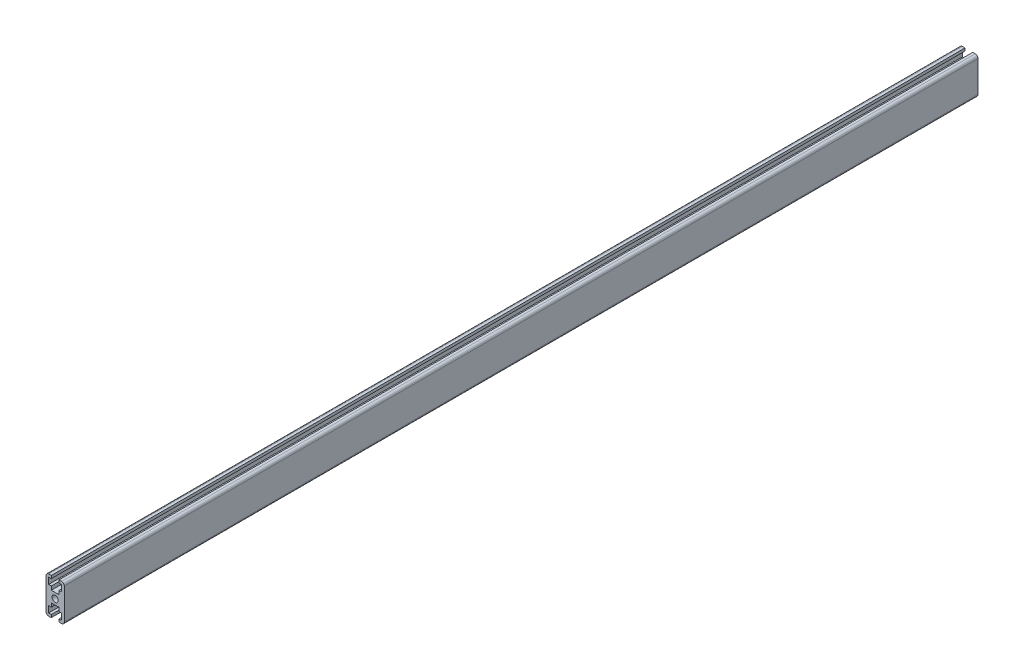
ISO-10303-21;
HEADER;
FILE_DESCRIPTION(('STEP AP214'),'2;1');
FILE_NAME('part.step','',(''),(''),'','','');
FILE_SCHEMA(('AUTOMOTIVE_DESIGN { 1 0 10303 214 1 1 1 1 }'));
ENDSEC;
DATA;
#1=APPLICATION_CONTEXT('core data for automotive mechanical design processes');
#2=APPLICATION_PROTOCOL_DEFINITION('international standard','automotive_design',2000,#1);
#3=PRODUCT_CONTEXT('',#1,'mechanical');
#4=PRODUCT('Part','Part','',(#3));
#5=PRODUCT_RELATED_PRODUCT_CATEGORY('part','',(#4));
#6=PRODUCT_DEFINITION_FORMATION('','',#4);
#7=PRODUCT_DEFINITION_CONTEXT('part definition',#1,'design');
#8=PRODUCT_DEFINITION('design','',#6,#7);
#9=PRODUCT_DEFINITION_SHAPE('','',#8);
#10=(LENGTH_UNIT() NAMED_UNIT(*) SI_UNIT(.MILLI.,.METRE.));
#11=(NAMED_UNIT(*) PLANE_ANGLE_UNIT() SI_UNIT($,.RADIAN.));
#12=(NAMED_UNIT(*) SI_UNIT($,.STERADIAN.) SOLID_ANGLE_UNIT());
#13=UNCERTAINTY_MEASURE_WITH_UNIT(LENGTH_MEASURE(1.E-05),#10,'distance_accuracy_value','');
#14=(GEOMETRIC_REPRESENTATION_CONTEXT(3) GLOBAL_UNCERTAINTY_ASSIGNED_CONTEXT((#13)) GLOBAL_UNIT_ASSIGNED_CONTEXT((#10,
#11,#12)) REPRESENTATION_CONTEXT('',''));
#15=CARTESIAN_POINT('',(0.,0.,0.));
#16=DIRECTION('',(0.,0.,1.));
#17=DIRECTION('',(1.,0.,0.));
#18=AXIS2_PLACEMENT_3D('',#15,#16,#17);
#19=CARTESIAN_POINT('',(1.43563322149805E-13,-20.,1000.));
#20=DIRECTION('',(0.,-1.,0.));
#21=DIRECTION('',(1.,0.,0.));
#22=AXIS2_PLACEMENT_3D('',#19,#20,#21);
#23=PLANE('',#22);
#24=DIRECTION('',(-1.,0.,0.));
#25=VECTOR('',#24,1.);
#26=CARTESIAN_POINT('',(1.43563322149805E-13,-20.,0.));
#27=LINE('',#26,#25);
#28=CARTESIAN_POINT('',(-4.1999999999999,-20.,0.));
#29=VERTEX_POINT('',#28);
#30=CARTESIAN_POINT('',(-7.,-20.,0.));
#31=VERTEX_POINT('',#30);
#32=EDGE_CURVE('E277',#29,#31,#27,.T.);
#33=ORIENTED_EDGE('',*,*,#32,.F.);
#34=DIRECTION('',(0.,0.,-1.));
#35=VECTOR('',#34,1.);
#36=CARTESIAN_POINT('',(-4.1999999999999,-20.,1000.));
#37=LINE('',#36,#35);
#38=CARTESIAN_POINT('',(-4.1999999999999,-20.,1000.));
#39=VERTEX_POINT('',#38);
#40=EDGE_CURVE('E11',#39,#29,#37,.T.);
#41=ORIENTED_EDGE('',*,*,#40,.F.);
#42=DIRECTION('',(-1.,0.,0.));
#43=VECTOR('',#42,1.);
#44=CARTESIAN_POINT('',(1.43563322149805E-13,-20.,1000.));
#45=LINE('',#44,#43);
#46=CARTESIAN_POINT('',(-7.,-20.,1000.));
#47=VERTEX_POINT('',#46);
#48=EDGE_CURVE('E369',#39,#47,#45,.T.);
#49=ORIENTED_EDGE('',*,*,#48,.T.);
#50=DIRECTION('',(0.,0.,-1.));
#51=VECTOR('',#50,1.);
#52=CARTESIAN_POINT('',(-7.,-20.,1000.));
#53=LINE('',#52,#51);
#54=EDGE_CURVE('E160',#47,#31,#53,.T.);
#55=ORIENTED_EDGE('',*,*,#54,.T.);
#56=EDGE_LOOP('',(#33,#41,#49,#55));
#57=FACE_BOUND('',#56,.T.);
#58=ADVANCED_FACE('F37',(#57),#23,.T.);
#59=CARTESIAN_POINT('',(-4.20000000000004,0.,1000.));
#60=DIRECTION('',(1.,0.,0.));
#61=DIRECTION('',(0.,1.,0.));
#62=AXIS2_PLACEMENT_3D('',#59,#60,#61);
#63=PLANE('',#62);
#64=DIRECTION('',(0.,-1.,0.));
#65=VECTOR('',#64,1.);
#66=CARTESIAN_POINT('',(-4.20000000000004,0.,0.));
#67=LINE('',#66,#65);
#68=CARTESIAN_POINT('',(-4.19999999999992,-17.,0.));
#69=VERTEX_POINT('',#68);
#70=EDGE_CURVE('E280',#69,#29,#67,.T.);
#71=ORIENTED_EDGE('',*,*,#70,.F.);
#72=DIRECTION('',(0.,0.,-1.));
#73=VECTOR('',#72,1.);
#74=CARTESIAN_POINT('',(-4.19999999999992,-17.,1000.));
#75=LINE('',#74,#73);
#76=CARTESIAN_POINT('',(-4.19999999999992,-17.,1000.));
#77=VERTEX_POINT('',#76);
#78=EDGE_CURVE('E45',#77,#69,#75,.T.);
#79=ORIENTED_EDGE('',*,*,#78,.F.);
#80=DIRECTION('',(0.,-1.,0.));
#81=VECTOR('',#80,1.);
#82=CARTESIAN_POINT('',(-4.20000000000004,0.,1000.));
#83=LINE('',#82,#81);
#84=EDGE_CURVE('E449',#77,#39,#83,.T.);
#85=ORIENTED_EDGE('',*,*,#84,.T.);
#86=ORIENTED_EDGE('',*,*,#40,.T.);
#87=EDGE_LOOP('',(#71,#79,#85,#86));
#88=FACE_BOUND('',#87,.T.);
#89=ADVANCED_FACE('F436',(#88),#63,.T.);
#90=CARTESIAN_POINT('',(1.22028823827334E-13,-17.,1000.));
#91=DIRECTION('',(0.,1.,0.));
#92=DIRECTION('',(-1.,0.,0.));
#93=AXIS2_PLACEMENT_3D('',#90,#91,#92);
#94=PLANE('',#93);
#95=DIRECTION('',(1.,0.,0.));
#96=VECTOR('',#95,1.);
#97=CARTESIAN_POINT('',(1.22028823827334E-13,-17.,0.));
#98=LINE('',#97,#96);
#99=CARTESIAN_POINT('',(-7.09999999999992,-17.0000000000001,0.));
#100=VERTEX_POINT('',#99);
#101=EDGE_CURVE('E283',#100,#69,#98,.T.);
#102=ORIENTED_EDGE('',*,*,#101,.F.);
#103=DIRECTION('',(0.,0.,-1.));
#104=VECTOR('',#103,1.);
#105=CARTESIAN_POINT('',(-7.09999999999992,-17.0000000000001,1000.));
#106=LINE('',#105,#104);
#107=CARTESIAN_POINT('',(-7.09999999999992,-17.0000000000001,1000.));
#108=VERTEX_POINT('',#107);
#109=EDGE_CURVE('E425',#108,#100,#106,.T.);
#110=ORIENTED_EDGE('',*,*,#109,.F.);
#111=DIRECTION('',(1.,0.,0.));
#112=VECTOR('',#111,1.);
#113=CARTESIAN_POINT('',(1.22028823827334E-13,-17.,1000.));
#114=LINE('',#113,#112);
#115=EDGE_CURVE('E432',#108,#77,#114,.T.);
#116=ORIENTED_EDGE('',*,*,#115,.T.);
#117=ORIENTED_EDGE('',*,*,#78,.T.);
#118=EDGE_LOOP('',(#102,#110,#116,#117));
#119=FACE_BOUND('',#118,.T.);
#120=ADVANCED_FACE('F430',(#119),#94,.T.);
#121=CARTESIAN_POINT('',(-7.10000000000004,0.,1000.));
#122=DIRECTION('',(1.,0.,0.));
#123=DIRECTION('',(0.,1.,0.));
#124=AXIS2_PLACEMENT_3D('',#121,#122,#123);
#125=PLANE('',#124);
#126=DIRECTION('',(0.,-1.,0.));
#127=VECTOR('',#126,1.);
#128=CARTESIAN_POINT('',(-7.10000000000004,0.,0.));
#129=LINE('',#128,#127);
#130=CARTESIAN_POINT('',(-7.09999999999997,-10.,0.));
#131=VERTEX_POINT('',#130);
#132=EDGE_CURVE('E286',#131,#100,#129,.T.);
#133=ORIENTED_EDGE('',*,*,#132,.F.);
#134=DIRECTION('',(0.,0.,-1.));
#135=VECTOR('',#134,1.);
#136=CARTESIAN_POINT('',(-7.09999999999997,-10.,1000.));
#137=LINE('',#136,#135);
#138=CARTESIAN_POINT('',(-7.09999999999997,-10.,1000.));
#139=VERTEX_POINT('',#138);
#140=EDGE_CURVE('E423',#139,#131,#137,.T.);
#141=ORIENTED_EDGE('',*,*,#140,.F.);
#142=DIRECTION('',(0.,-1.,0.));
#143=VECTOR('',#142,1.);
#144=CARTESIAN_POINT('',(-7.10000000000004,0.,1000.));
#145=LINE('',#144,#143);
#146=EDGE_CURVE('E446',#139,#108,#145,.T.);
#147=ORIENTED_EDGE('',*,*,#146,.T.);
#148=ORIENTED_EDGE('',*,*,#109,.T.);
#149=EDGE_LOOP('',(#133,#141,#147,#148));
#150=FACE_BOUND('',#149,.T.);
#151=ADVANCED_FACE('F443',(#150),#125,.T.);
#152=CARTESIAN_POINT('',(0.,-10.,1000.));
#153=DIRECTION('',(0.,-1.,0.));
#154=DIRECTION('',(1.,0.,0.));
#155=AXIS2_PLACEMENT_3D('',#152,#153,#154);
#156=PLANE('',#155);
#157=DIRECTION('',(-1.,0.,0.));
#158=VECTOR('',#157,1.);
#159=CARTESIAN_POINT('',(0.,-10.,0.));
#160=LINE('',#159,#158);
#161=CARTESIAN_POINT('',(-4.19999999999997,-10.,0.));
#162=VERTEX_POINT('',#161);
#163=EDGE_CURVE('E289',#162,#131,#160,.T.);
#164=ORIENTED_EDGE('',*,*,#163,.F.);
#165=DIRECTION('',(0.,0.,-1.));
#166=VECTOR('',#165,1.);
#167=CARTESIAN_POINT('',(-4.19999999999997,-10.,1000.));
#168=LINE('',#167,#166);
#169=CARTESIAN_POINT('',(-4.19999999999997,-10.,1000.));
#170=VERTEX_POINT('',#169);
#171=EDGE_CURVE('E421',#170,#162,#168,.T.);
#172=ORIENTED_EDGE('',*,*,#171,.F.);
#173=DIRECTION('',(-1.,0.,0.));
#174=VECTOR('',#173,1.);
#175=CARTESIAN_POINT('',(0.,-10.,1000.));
#176=LINE('',#175,#174);
#177=EDGE_CURVE('E451',#170,#139,#176,.T.);
#178=ORIENTED_EDGE('',*,*,#177,.T.);
#179=ORIENTED_EDGE('',*,*,#140,.T.);
#180=EDGE_LOOP('',(#164,#172,#178,#179));
#181=FACE_BOUND('',#180,.T.);
#182=ADVANCED_FACE('F540',(#181),#156,.T.);
#183=CARTESIAN_POINT('',(-4.20000000000004,0.,1000.));
#184=DIRECTION('',(1.,0.,0.));
#185=DIRECTION('',(0.,1.,0.));
#186=AXIS2_PLACEMENT_3D('',#183,#184,#185);
#187=PLANE('',#186);
#188=DIRECTION('',(0.,-1.,0.));
#189=VECTOR('',#188,1.);
#190=CARTESIAN_POINT('',(-4.20000000000004,0.,0.));
#191=LINE('',#190,#189);
#192=CARTESIAN_POINT('',(-4.2,-6.00000000000003,0.));
#193=VERTEX_POINT('',#192);
#194=EDGE_CURVE('E292',#193,#162,#191,.T.);
#195=ORIENTED_EDGE('',*,*,#194,.F.);
#196=DIRECTION('',(0.,0.,-1.));
#197=VECTOR('',#196,1.);
#198=CARTESIAN_POINT('',(-4.2,-6.00000000000003,1000.));
#199=LINE('',#198,#197);
#200=CARTESIAN_POINT('',(-4.2,-6.00000000000003,1000.));
#201=VERTEX_POINT('',#200);
#202=EDGE_CURVE('E419',#201,#193,#199,.T.);
#203=ORIENTED_EDGE('',*,*,#202,.F.);
#204=DIRECTION('',(0.,-1.,0.));
#205=VECTOR('',#204,1.);
#206=CARTESIAN_POINT('',(-4.20000000000004,0.,1000.));
#207=LINE('',#206,#205);
#208=EDGE_CURVE('E457',#201,#170,#207,.T.);
#209=ORIENTED_EDGE('',*,*,#208,.T.);
#210=ORIENTED_EDGE('',*,*,#171,.T.);
#211=EDGE_LOOP('',(#195,#203,#209,#210));
#212=FACE_BOUND('',#211,.T.);
#213=ADVANCED_FACE('F543',(#212),#187,.T.);
#214=CARTESIAN_POINT('',(0.,-6.,1000.));
#215=DIRECTION('',(0.,-1.,0.));
#216=DIRECTION('',(1.,0.,0.));
#217=AXIS2_PLACEMENT_3D('',#214,#215,#216);
#218=PLANE('',#217);
#219=DIRECTION('',(-1.,0.,0.));
#220=VECTOR('',#219,1.);
#221=CARTESIAN_POINT('',(0.,-6.,0.));
#222=LINE('',#221,#220);
#223=CARTESIAN_POINT('',(4.2,-5.99999999999997,0.));
#224=VERTEX_POINT('',#223);
#225=EDGE_CURVE('E295',#224,#193,#222,.T.);
#226=ORIENTED_EDGE('',*,*,#225,.F.);
#227=DIRECTION('',(0.,0.,-1.));
#228=VECTOR('',#227,1.);
#229=CARTESIAN_POINT('',(4.2,-5.99999999999997,1000.));
#230=LINE('',#229,#228);
#231=CARTESIAN_POINT('',(4.2,-5.99999999999997,1000.));
#232=VERTEX_POINT('',#231);
#233=EDGE_CURVE('E417',#232,#224,#230,.T.);
#234=ORIENTED_EDGE('',*,*,#233,.F.);
#235=DIRECTION('',(-1.,0.,0.));
#236=VECTOR('',#235,1.);
#237=CARTESIAN_POINT('',(0.,-6.,1000.));
#238=LINE('',#237,#236);
#239=EDGE_CURVE('E460',#232,#201,#238,.T.);
#240=ORIENTED_EDGE('',*,*,#239,.T.);
#241=ORIENTED_EDGE('',*,*,#202,.T.);
#242=EDGE_LOOP('',(#226,#234,#240,#241));
#243=FACE_BOUND('',#242,.T.);
#244=ADVANCED_FACE('F547',(#243),#218,.T.);
#245=CARTESIAN_POINT('',(4.19999999999996,0.,1000.));
#246=DIRECTION('',(-1.,0.,0.));
#247=DIRECTION('',(0.,-1.,0.));
#248=AXIS2_PLACEMENT_3D('',#245,#246,#247);
#249=PLANE('',#248);
#250=DIRECTION('',(0.,1.,0.));
#251=VECTOR('',#250,1.);
#252=CARTESIAN_POINT('',(4.19999999999996,0.,0.));
#253=LINE('',#252,#251);
#254=CARTESIAN_POINT('',(4.20000000000003,-9.99999999999997,0.));
#255=VERTEX_POINT('',#254);
#256=EDGE_CURVE('E298',#255,#224,#253,.T.);
#257=ORIENTED_EDGE('',*,*,#256,.F.);
#258=DIRECTION('',(0.,0.,-1.));
#259=VECTOR('',#258,1.);
#260=CARTESIAN_POINT('',(4.20000000000003,-9.99999999999997,1000.));
#261=LINE('',#260,#259);
#262=CARTESIAN_POINT('',(4.20000000000003,-9.99999999999997,1000.));
#263=VERTEX_POINT('',#262);
#264=EDGE_CURVE('E415',#263,#255,#261,.T.);
#265=ORIENTED_EDGE('',*,*,#264,.F.);
#266=DIRECTION('',(0.,1.,0.));
#267=VECTOR('',#266,1.);
#268=CARTESIAN_POINT('',(4.19999999999996,0.,1000.));
#269=LINE('',#268,#267);
#270=EDGE_CURVE('E463',#263,#232,#269,.T.);
#271=ORIENTED_EDGE('',*,*,#270,.T.);
#272=ORIENTED_EDGE('',*,*,#233,.T.);
#273=EDGE_LOOP('',(#257,#265,#271,#272));
#274=FACE_BOUND('',#273,.T.);
#275=ADVANCED_FACE('F551',(#274),#249,.T.);
#276=CARTESIAN_POINT('',(0.,-10.,1000.));
#277=DIRECTION('',(0.,-1.,0.));
#278=DIRECTION('',(1.,0.,0.));
#279=AXIS2_PLACEMENT_3D('',#276,#277,#278);
#280=PLANE('',#279);
#281=DIRECTION('',(-1.,0.,0.));
#282=VECTOR('',#281,1.);
#283=CARTESIAN_POINT('',(0.,-10.,0.));
#284=LINE('',#283,#282);
#285=CARTESIAN_POINT('',(7.10000000000003,-9.99999999999995,0.));
#286=VERTEX_POINT('',#285);
#287=EDGE_CURVE('E301',#286,#255,#284,.T.);
#288=ORIENTED_EDGE('',*,*,#287,.F.);
#289=DIRECTION('',(0.,0.,-1.));
#290=VECTOR('',#289,1.);
#291=CARTESIAN_POINT('',(7.10000000000003,-9.99999999999995,1000.));
#292=LINE('',#291,#290);
#293=CARTESIAN_POINT('',(7.10000000000003,-9.99999999999995,1000.));
#294=VERTEX_POINT('',#293);
#295=EDGE_CURVE('E413',#294,#286,#292,.T.);
#296=ORIENTED_EDGE('',*,*,#295,.F.);
#297=DIRECTION('',(-1.,0.,0.));
#298=VECTOR('',#297,1.);
#299=CARTESIAN_POINT('',(0.,-10.,1000.));
#300=LINE('',#299,#298);
#301=EDGE_CURVE('E466',#294,#263,#300,.T.);
#302=ORIENTED_EDGE('',*,*,#301,.T.);
#303=ORIENTED_EDGE('',*,*,#264,.T.);
#304=EDGE_LOOP('',(#288,#296,#302,#303));
#305=FACE_BOUND('',#304,.T.);
#306=ADVANCED_FACE('F555',(#305),#280,.T.);
#307=CARTESIAN_POINT('',(7.09999999999995,0.,1000.));
#308=DIRECTION('',(-1.,0.,0.));
#309=DIRECTION('',(0.,-1.,0.));
#310=AXIS2_PLACEMENT_3D('',#307,#308,#309);
#311=PLANE('',#310);
#312=DIRECTION('',(0.,1.,0.));
#313=VECTOR('',#312,1.);
#314=CARTESIAN_POINT('',(7.09999999999995,0.,0.));
#315=LINE('',#314,#313);
#316=CARTESIAN_POINT('',(7.10000000000008,-17.,0.));
#317=VERTEX_POINT('',#316);
#318=EDGE_CURVE('E304',#317,#286,#315,.T.);
#319=ORIENTED_EDGE('',*,*,#318,.F.);
#320=DIRECTION('',(0.,0.,-1.));
#321=VECTOR('',#320,1.);
#322=CARTESIAN_POINT('',(7.10000000000008,-17.,1000.));
#323=LINE('',#322,#321);
#324=CARTESIAN_POINT('',(7.10000000000008,-17.,1000.));
#325=VERTEX_POINT('',#324);
#326=EDGE_CURVE('E411',#325,#317,#323,.T.);
#327=ORIENTED_EDGE('',*,*,#326,.F.);
#328=DIRECTION('',(0.,1.,0.));
#329=VECTOR('',#328,1.);
#330=CARTESIAN_POINT('',(7.09999999999995,0.,1000.));
#331=LINE('',#330,#329);
#332=EDGE_CURVE('E469',#325,#294,#331,.T.);
#333=ORIENTED_EDGE('',*,*,#332,.T.);
#334=ORIENTED_EDGE('',*,*,#295,.T.);
#335=EDGE_LOOP('',(#319,#327,#333,#334));
#336=FACE_BOUND('',#335,.T.);
#337=ADVANCED_FACE('F559',(#336),#311,.T.);
#338=CARTESIAN_POINT('',(1.22028823827334E-13,-17.,1000.));
#339=DIRECTION('',(0.,1.,0.));
#340=DIRECTION('',(-1.,0.,0.));
#341=AXIS2_PLACEMENT_3D('',#338,#339,#340);
#342=PLANE('',#341);
#343=DIRECTION('',(1.,0.,0.));
#344=VECTOR('',#343,1.);
#345=CARTESIAN_POINT('',(1.22028823827334E-13,-17.,0.));
#346=LINE('',#345,#344);
#347=CARTESIAN_POINT('',(4.20000000000008,-17.,0.));
#348=VERTEX_POINT('',#347);
#349=EDGE_CURVE('E307',#348,#317,#346,.T.);
#350=ORIENTED_EDGE('',*,*,#349,.F.);
#351=DIRECTION('',(0.,0.,-1.));
#352=VECTOR('',#351,1.);
#353=CARTESIAN_POINT('',(4.20000000000008,-17.,1000.));
#354=LINE('',#353,#352);
#355=CARTESIAN_POINT('',(4.20000000000008,-17.,1000.));
#356=VERTEX_POINT('',#355);
#357=EDGE_CURVE('E409',#356,#348,#354,.T.);
#358=ORIENTED_EDGE('',*,*,#357,.F.);
#359=DIRECTION('',(1.,0.,0.));
#360=VECTOR('',#359,1.);
#361=CARTESIAN_POINT('',(1.22028823827334E-13,-17.,1000.));
#362=LINE('',#361,#360);
#363=EDGE_CURVE('E472',#356,#325,#362,.T.);
#364=ORIENTED_EDGE('',*,*,#363,.T.);
#365=ORIENTED_EDGE('',*,*,#326,.T.);
#366=EDGE_LOOP('',(#350,#358,#364,#365));
#367=FACE_BOUND('',#366,.T.);
#368=ADVANCED_FACE('F563',(#367),#342,.T.);
#369=CARTESIAN_POINT('',(4.19999999999996,0.,1000.));
#370=DIRECTION('',(-1.,0.,0.));
#371=DIRECTION('',(0.,-1.,0.));
#372=AXIS2_PLACEMENT_3D('',#369,#370,#371);
#373=PLANE('',#372);
#374=DIRECTION('',(0.,1.,0.));
#375=VECTOR('',#374,1.);
#376=CARTESIAN_POINT('',(4.19999999999996,0.,0.));
#377=LINE('',#376,#375);
#378=CARTESIAN_POINT('',(4.2000000000001,-20.,0.));
#379=VERTEX_POINT('',#378);
#380=EDGE_CURVE('E310',#379,#348,#377,.T.);
#381=ORIENTED_EDGE('',*,*,#380,.F.);
#382=DIRECTION('',(0.,0.,-1.));
#383=VECTOR('',#382,1.);
#384=CARTESIAN_POINT('',(4.2000000000001,-20.,1000.));
#385=LINE('',#384,#383);
#386=CARTESIAN_POINT('',(4.2000000000001,-20.,1000.));
#387=VERTEX_POINT('',#386);
#388=EDGE_CURVE('E407',#387,#379,#385,.T.);
#389=ORIENTED_EDGE('',*,*,#388,.F.);
#390=DIRECTION('',(0.,1.,0.));
#391=VECTOR('',#390,1.);
#392=CARTESIAN_POINT('',(4.19999999999996,0.,1000.));
#393=LINE('',#392,#391);
#394=EDGE_CURVE('E475',#387,#356,#393,.T.);
#395=ORIENTED_EDGE('',*,*,#394,.T.);
#396=ORIENTED_EDGE('',*,*,#357,.T.);
#397=EDGE_LOOP('',(#381,#389,#395,#396));
#398=FACE_BOUND('',#397,.T.);
#399=ADVANCED_FACE('F567',(#398),#373,.T.);
#400=CARTESIAN_POINT('',(1.19636101791504E-13,-20.,1000.));
#401=DIRECTION('',(0.,-1.,0.));
#402=DIRECTION('',(1.,0.,0.));
#403=AXIS2_PLACEMENT_3D('',#400,#401,#402);
#404=PLANE('',#403);
#405=DIRECTION('',(-1.,0.,0.));
#406=VECTOR('',#405,1.);
#407=CARTESIAN_POINT('',(1.19636101791504E-13,-20.,0.));
#408=LINE('',#407,#406);
#409=CARTESIAN_POINT('',(7.,-20.,0.));
#410=VERTEX_POINT('',#409);
#411=EDGE_CURVE('E313',#410,#379,#408,.T.);
#412=ORIENTED_EDGE('',*,*,#411,.F.);
#413=DIRECTION('',(0.,0.,-1.));
#414=VECTOR('',#413,1.);
#415=CARTESIAN_POINT('',(7.,-20.,1000.));
#416=LINE('',#415,#414);
#417=CARTESIAN_POINT('',(7.,-20.,1000.));
#418=VERTEX_POINT('',#417);
#419=EDGE_CURVE('E405',#418,#410,#416,.T.);
#420=ORIENTED_EDGE('',*,*,#419,.F.);
#421=DIRECTION('',(-1.,0.,0.));
#422=VECTOR('',#421,1.);
#423=CARTESIAN_POINT('',(1.19636101791504E-13,-20.,1000.));
#424=LINE('',#423,#422);
#425=EDGE_CURVE('E478',#418,#387,#424,.T.);
#426=ORIENTED_EDGE('',*,*,#425,.T.);
#427=ORIENTED_EDGE('',*,*,#388,.T.);
#428=EDGE_LOOP('',(#412,#420,#426,#427));
#429=FACE_BOUND('',#428,.T.);
#430=ADVANCED_FACE('F571',(#429),#404,.T.);
#431=CARTESIAN_POINT('',(7.,-17.,1000.));
#432=DIRECTION('',(0.,0.,-1.));
#433=DIRECTION('',(-1.,0.,0.));
#434=AXIS2_PLACEMENT_3D('',#431,#432,#433);
#435=CYLINDRICAL_SURFACE('',#434,3.);
#436=CARTESIAN_POINT('',(7.,-17.,0.));
#437=DIRECTION('',(0.,0.,1.));
#438=DIRECTION('',(1.,0.,0.));
#439=AXIS2_PLACEMENT_3D('',#436,#437,#438);
#440=CIRCLE('',#439,3.);
#441=CARTESIAN_POINT('',(10.,-17.,0.));
#442=VERTEX_POINT('',#441);
#443=EDGE_CURVE('E316',#410,#442,#440,.T.);
#444=ORIENTED_EDGE('',*,*,#443,.T.);
#445=DIRECTION('',(0.,0.,-1.));
#446=VECTOR('',#445,1.);
#447=CARTESIAN_POINT('',(10.,-17.,1000.));
#448=LINE('',#447,#446);
#449=CARTESIAN_POINT('',(10.,-17.,1000.));
#450=VERTEX_POINT('',#449);
#451=EDGE_CURVE('E402',#450,#442,#448,.T.);
#452=ORIENTED_EDGE('',*,*,#451,.F.);
#453=CARTESIAN_POINT('',(7.,-17.,1000.));
#454=DIRECTION('',(0.,0.,1.));
#455=DIRECTION('',(1.,0.,0.));
#456=AXIS2_PLACEMENT_3D('',#453,#454,#455);
#457=CIRCLE('',#456,3.);
#458=EDGE_CURVE('E481',#418,#450,#457,.T.);
#459=ORIENTED_EDGE('',*,*,#458,.F.);
#460=ORIENTED_EDGE('',*,*,#419,.T.);
#461=EDGE_LOOP('',(#444,#452,#459,#460));
#462=FACE_BOUND('',#461,.T.);
#463=ADVANCED_FACE('F575',(#462),#435,.T.);
#464=CARTESIAN_POINT('',(10.,0.,1000.));
#465=DIRECTION('',(-1.,0.,0.));
#466=DIRECTION('',(0.,0.,1.));
#467=AXIS2_PLACEMENT_3D('',#464,#465,#466);
#468=PLANE('',#467);
#469=DIRECTION('',(0.,1.,0.));
#470=VECTOR('',#469,1.);
#471=CARTESIAN_POINT('',(10.,0.,0.));
#472=LINE('',#471,#470);
#473=CARTESIAN_POINT('',(10.,17.,0.));
#474=VERTEX_POINT('',#473);
#475=EDGE_CURVE('E318',#442,#474,#472,.T.);
#476=ORIENTED_EDGE('',*,*,#475,.T.);
#477=DIRECTION('',(0.,0.,-1.));
#478=VECTOR('',#477,1.);
#479=CARTESIAN_POINT('',(10.,17.,1000.));
#480=LINE('',#479,#478);
#481=CARTESIAN_POINT('',(10.,17.,1000.));
#482=VERTEX_POINT('',#481);
#483=EDGE_CURVE('E399',#482,#474,#480,.T.);
#484=ORIENTED_EDGE('',*,*,#483,.F.);
#485=DIRECTION('',(0.,1.,0.));
#486=VECTOR('',#485,1.);
#487=CARTESIAN_POINT('',(10.,0.,1000.));
#488=LINE('',#487,#486);
#489=EDGE_CURVE('E483',#450,#482,#488,.T.);
#490=ORIENTED_EDGE('',*,*,#489,.F.);
#491=ORIENTED_EDGE('',*,*,#451,.T.);
#492=EDGE_LOOP('',(#476,#484,#490,#491));
#493=FACE_BOUND('',#492,.T.);
#494=ADVANCED_FACE('F579',(#493),#468,.F.);
#495=CARTESIAN_POINT('',(7.,17.,1000.));
#496=DIRECTION('',(0.,0.,-1.));
#497=DIRECTION('',(-1.,0.,0.));
#498=AXIS2_PLACEMENT_3D('',#495,#496,#497);
#499=CYLINDRICAL_SURFACE('',#498,3.);
#500=CARTESIAN_POINT('',(7.,17.,0.));
#501=DIRECTION('',(0.,0.,1.));
#502=DIRECTION('',(1.,0.,0.));
#503=AXIS2_PLACEMENT_3D('',#500,#501,#502);
#504=CIRCLE('',#503,3.);
#505=CARTESIAN_POINT('',(7.,20.,0.));
#506=VERTEX_POINT('',#505);
#507=EDGE_CURVE('E320',#474,#506,#504,.T.);
#508=ORIENTED_EDGE('',*,*,#507,.T.);
#509=DIRECTION('',(0.,0.,-1.));
#510=VECTOR('',#509,1.);
#511=CARTESIAN_POINT('',(7.,20.,1000.));
#512=LINE('',#511,#510);
#513=CARTESIAN_POINT('',(7.,20.,1000.));
#514=VERTEX_POINT('',#513);
#515=EDGE_CURVE('E397',#514,#506,#512,.T.);
#516=ORIENTED_EDGE('',*,*,#515,.F.);
#517=CARTESIAN_POINT('',(7.,17.,1000.));
#518=DIRECTION('',(0.,0.,1.));
#519=DIRECTION('',(1.,0.,0.));
#520=AXIS2_PLACEMENT_3D('',#517,#518,#519);
#521=CIRCLE('',#520,3.);
#522=EDGE_CURVE('E485',#482,#514,#521,.T.);
#523=ORIENTED_EDGE('',*,*,#522,.F.);
#524=ORIENTED_EDGE('',*,*,#483,.T.);
#525=EDGE_LOOP('',(#508,#516,#523,#524));
#526=FACE_BOUND('',#525,.T.);
#527=ADVANCED_FACE('F583',(#526),#499,.T.);
#528=CARTESIAN_POINT('',(0.,20.,1000.));
#529=DIRECTION('',(0.,1.,0.));
#530=DIRECTION('',(0.,0.,1.));
#531=AXIS2_PLACEMENT_3D('',#528,#529,#530);
#532=PLANE('',#531);
#533=DIRECTION('',(1.,0.,0.));
#534=VECTOR('',#533,1.);
#535=CARTESIAN_POINT('',(0.,20.,0.));
#536=LINE('',#535,#534);
#537=CARTESIAN_POINT('',(4.2,20.,0.));
#538=VERTEX_POINT('',#537);
#539=EDGE_CURVE('E323',#538,#506,#536,.T.);
#540=ORIENTED_EDGE('',*,*,#539,.F.);
#541=DIRECTION('',(0.,0.,-1.));
#542=VECTOR('',#541,1.);
#543=CARTESIAN_POINT('',(4.2,20.,1000.));
#544=LINE('',#543,#542);
#545=CARTESIAN_POINT('',(4.2,20.,1000.));
#546=VERTEX_POINT('',#545);
#547=EDGE_CURVE('E395',#546,#538,#544,.T.);
#548=ORIENTED_EDGE('',*,*,#547,.F.);
#549=DIRECTION('',(1.,0.,0.));
#550=VECTOR('',#549,1.);
#551=CARTESIAN_POINT('',(0.,20.,1000.));
#552=LINE('',#551,#550);
#553=EDGE_CURVE('E487',#546,#514,#552,.T.);
#554=ORIENTED_EDGE('',*,*,#553,.T.);
#555=ORIENTED_EDGE('',*,*,#515,.T.);
#556=EDGE_LOOP('',(#540,#548,#554,#555));
#557=FACE_BOUND('',#556,.T.);
#558=ADVANCED_FACE('F587',(#557),#532,.T.);
#559=CARTESIAN_POINT('',(4.2,0.,1000.));
#560=DIRECTION('',(-1.,0.,0.));
#561=DIRECTION('',(0.,0.,1.));
#562=AXIS2_PLACEMENT_3D('',#559,#560,#561);
#563=PLANE('',#562);
#564=DIRECTION('',(0.,1.,0.));
#565=VECTOR('',#564,1.);
#566=CARTESIAN_POINT('',(4.2,0.,0.));
#567=LINE('',#566,#565);
#568=CARTESIAN_POINT('',(4.2,17.,0.));
#569=VERTEX_POINT('',#568);
#570=EDGE_CURVE('E326',#569,#538,#567,.T.);
#571=ORIENTED_EDGE('',*,*,#570,.F.);
#572=DIRECTION('',(0.,0.,-1.));
#573=VECTOR('',#572,1.);
#574=CARTESIAN_POINT('',(4.2,17.,1000.));
#575=LINE('',#574,#573);
#576=CARTESIAN_POINT('',(4.2,17.,1000.));
#577=VERTEX_POINT('',#576);
#578=EDGE_CURVE('E393',#577,#569,#575,.T.);
#579=ORIENTED_EDGE('',*,*,#578,.F.);
#580=DIRECTION('',(0.,1.,0.));
#581=VECTOR('',#580,1.);
#582=CARTESIAN_POINT('',(4.2,0.,1000.));
#583=LINE('',#582,#581);
#584=EDGE_CURVE('E490',#577,#546,#583,.T.);
#585=ORIENTED_EDGE('',*,*,#584,.T.);
#586=ORIENTED_EDGE('',*,*,#547,.T.);
#587=EDGE_LOOP('',(#571,#579,#585,#586));
#588=FACE_BOUND('',#587,.T.);
#589=ADVANCED_FACE('F591',(#588),#563,.T.);
#590=CARTESIAN_POINT('',(0.,17.,1000.));
#591=DIRECTION('',(0.,-1.,0.));
#592=DIRECTION('',(0.,0.,-1.));
#593=AXIS2_PLACEMENT_3D('',#590,#591,#592);
#594=PLANE('',#593);
#595=DIRECTION('',(-1.,0.,0.));
#596=VECTOR('',#595,1.);
#597=CARTESIAN_POINT('',(0.,17.,0.));
#598=LINE('',#597,#596);
#599=CARTESIAN_POINT('',(7.1,17.,0.));
#600=VERTEX_POINT('',#599);
#601=EDGE_CURVE('E329',#600,#569,#598,.T.);
#602=ORIENTED_EDGE('',*,*,#601,.F.);
#603=DIRECTION('',(0.,0.,-1.));
#604=VECTOR('',#603,1.);
#605=CARTESIAN_POINT('',(7.1,17.,1000.));
#606=LINE('',#605,#604);
#607=CARTESIAN_POINT('',(7.1,17.,1000.));
#608=VERTEX_POINT('',#607);
#609=EDGE_CURVE('E391',#608,#600,#606,.T.);
#610=ORIENTED_EDGE('',*,*,#609,.F.);
#611=DIRECTION('',(-1.,0.,0.));
#612=VECTOR('',#611,1.);
#613=CARTESIAN_POINT('',(0.,17.,1000.));
#614=LINE('',#613,#612);
#615=EDGE_CURVE('E493',#608,#577,#614,.T.);
#616=ORIENTED_EDGE('',*,*,#615,.T.);
#617=ORIENTED_EDGE('',*,*,#578,.T.);
#618=EDGE_LOOP('',(#602,#610,#616,#617));
#619=FACE_BOUND('',#618,.T.);
#620=ADVANCED_FACE('F595',(#619),#594,.T.);
#621=CARTESIAN_POINT('',(7.1,0.,1000.));
#622=DIRECTION('',(-1.,0.,0.));
#623=DIRECTION('',(0.,0.,1.));
#624=AXIS2_PLACEMENT_3D('',#621,#622,#623);
#625=PLANE('',#624);
#626=DIRECTION('',(0.,1.,0.));
#627=VECTOR('',#626,1.);
#628=CARTESIAN_POINT('',(7.1,0.,0.));
#629=LINE('',#628,#627);
#630=CARTESIAN_POINT('',(7.1,9.99999999999997,0.));
#631=VERTEX_POINT('',#630);
#632=EDGE_CURVE('E332',#631,#600,#629,.T.);
#633=ORIENTED_EDGE('',*,*,#632,.F.);
#634=DIRECTION('',(0.,0.,-1.));
#635=VECTOR('',#634,1.);
#636=CARTESIAN_POINT('',(7.1,9.99999999999997,1000.));
#637=LINE('',#636,#635);
#638=CARTESIAN_POINT('',(7.1,9.99999999999997,1000.));
#639=VERTEX_POINT('',#638);
#640=EDGE_CURVE('E389',#639,#631,#637,.T.);
#641=ORIENTED_EDGE('',*,*,#640,.F.);
#642=DIRECTION('',(0.,1.,0.));
#643=VECTOR('',#642,1.);
#644=CARTESIAN_POINT('',(7.1,0.,1000.));
#645=LINE('',#644,#643);
#646=EDGE_CURVE('E496',#639,#608,#645,.T.);
#647=ORIENTED_EDGE('',*,*,#646,.T.);
#648=ORIENTED_EDGE('',*,*,#609,.T.);
#649=EDGE_LOOP('',(#633,#641,#647,#648));
#650=FACE_BOUND('',#649,.T.);
#651=ADVANCED_FACE('F599',(#650),#625,.T.);
#652=CARTESIAN_POINT('',(0.,9.99999999999997,1000.));
#653=DIRECTION('',(0.,1.,0.));
#654=DIRECTION('',(0.,0.,1.));
#655=AXIS2_PLACEMENT_3D('',#652,#653,#654);
#656=PLANE('',#655);
#657=DIRECTION('',(1.,0.,0.));
#658=VECTOR('',#657,1.);
#659=CARTESIAN_POINT('',(0.,9.99999999999997,0.));
#660=LINE('',#659,#658);
#661=CARTESIAN_POINT('',(4.2,9.99999999999997,0.));
#662=VERTEX_POINT('',#661);
#663=EDGE_CURVE('E335',#662,#631,#660,.T.);
#664=ORIENTED_EDGE('',*,*,#663,.F.);
#665=DIRECTION('',(0.,0.,-1.));
#666=VECTOR('',#665,1.);
#667=CARTESIAN_POINT('',(4.2,9.99999999999997,1000.));
#668=LINE('',#667,#666);
#669=CARTESIAN_POINT('',(4.2,9.99999999999997,1000.));
#670=VERTEX_POINT('',#669);
#671=EDGE_CURVE('E387',#670,#662,#668,.T.);
#672=ORIENTED_EDGE('',*,*,#671,.F.);
#673=DIRECTION('',(1.,0.,0.));
#674=VECTOR('',#673,1.);
#675=CARTESIAN_POINT('',(0.,9.99999999999997,1000.));
#676=LINE('',#675,#674);
#677=EDGE_CURVE('E499',#670,#639,#676,.T.);
#678=ORIENTED_EDGE('',*,*,#677,.T.);
#679=ORIENTED_EDGE('',*,*,#640,.T.);
#680=EDGE_LOOP('',(#664,#672,#678,#679));
#681=FACE_BOUND('',#680,.T.);
#682=ADVANCED_FACE('F603',(#681),#656,.T.);
#683=CARTESIAN_POINT('',(4.2,0.,1000.));
#684=DIRECTION('',(-1.,0.,0.));
#685=DIRECTION('',(0.,0.,1.));
#686=AXIS2_PLACEMENT_3D('',#683,#684,#685);
#687=PLANE('',#686);
#688=DIRECTION('',(0.,1.,0.));
#689=VECTOR('',#688,1.);
#690=CARTESIAN_POINT('',(4.2,0.,0.));
#691=LINE('',#690,#689);
#692=CARTESIAN_POINT('',(4.2,5.99999999999997,0.));
#693=VERTEX_POINT('',#692);
#694=EDGE_CURVE('E338',#693,#662,#691,.T.);
#695=ORIENTED_EDGE('',*,*,#694,.F.);
#696=DIRECTION('',(0.,0.,-1.));
#697=VECTOR('',#696,1.);
#698=CARTESIAN_POINT('',(4.2,5.99999999999997,1000.));
#699=LINE('',#698,#697);
#700=CARTESIAN_POINT('',(4.2,5.99999999999997,1000.));
#701=VERTEX_POINT('',#700);
#702=EDGE_CURVE('E385',#701,#693,#699,.T.);
#703=ORIENTED_EDGE('',*,*,#702,.F.);
#704=DIRECTION('',(0.,1.,0.));
#705=VECTOR('',#704,1.);
#706=CARTESIAN_POINT('',(4.2,0.,1000.));
#707=LINE('',#706,#705);
#708=EDGE_CURVE('E502',#701,#670,#707,.T.);
#709=ORIENTED_EDGE('',*,*,#708,.T.);
#710=ORIENTED_EDGE('',*,*,#671,.T.);
#711=EDGE_LOOP('',(#695,#703,#709,#710));
#712=FACE_BOUND('',#711,.T.);
#713=ADVANCED_FACE('F607',(#712),#687,.T.);
#714=CARTESIAN_POINT('',(0.,5.99999999999997,1000.));
#715=DIRECTION('',(0.,1.,0.));
#716=DIRECTION('',(0.,0.,1.));
#717=AXIS2_PLACEMENT_3D('',#714,#715,#716);
#718=PLANE('',#717);
#719=DIRECTION('',(1.,0.,0.));
#720=VECTOR('',#719,1.);
#721=CARTESIAN_POINT('',(0.,5.99999999999997,0.));
#722=LINE('',#721,#720);
#723=CARTESIAN_POINT('',(-4.2,5.99999999999997,0.));
#724=VERTEX_POINT('',#723);
#725=EDGE_CURVE('E341',#724,#693,#722,.T.);
#726=ORIENTED_EDGE('',*,*,#725,.F.);
#727=DIRECTION('',(0.,0.,-1.));
#728=VECTOR('',#727,1.);
#729=CARTESIAN_POINT('',(-4.2,5.99999999999997,1000.));
#730=LINE('',#729,#728);
#731=CARTESIAN_POINT('',(-4.2,5.99999999999997,1000.));
#732=VERTEX_POINT('',#731);
#733=EDGE_CURVE('E383',#732,#724,#730,.T.);
#734=ORIENTED_EDGE('',*,*,#733,.F.);
#735=DIRECTION('',(1.,0.,0.));
#736=VECTOR('',#735,1.);
#737=CARTESIAN_POINT('',(0.,5.99999999999997,1000.));
#738=LINE('',#737,#736);
#739=EDGE_CURVE('E505',#732,#701,#738,.T.);
#740=ORIENTED_EDGE('',*,*,#739,.T.);
#741=ORIENTED_EDGE('',*,*,#702,.T.);
#742=EDGE_LOOP('',(#726,#734,#740,#741));
#743=FACE_BOUND('',#742,.T.);
#744=ADVANCED_FACE('F611',(#743),#718,.T.);
#745=CARTESIAN_POINT('',(-4.2,0.,1000.));
#746=DIRECTION('',(1.,0.,0.));
#747=DIRECTION('',(0.,1.,0.));
#748=AXIS2_PLACEMENT_3D('',#745,#746,#747);
#749=PLANE('',#748);
#750=DIRECTION('',(0.,-1.,0.));
#751=VECTOR('',#750,1.);
#752=CARTESIAN_POINT('',(-4.2,0.,0.));
#753=LINE('',#752,#751);
#754=CARTESIAN_POINT('',(-4.2,9.99999999999997,0.));
#755=VERTEX_POINT('',#754);
#756=EDGE_CURVE('E344',#755,#724,#753,.T.);
#757=ORIENTED_EDGE('',*,*,#756,.F.);
#758=DIRECTION('',(0.,0.,-1.));
#759=VECTOR('',#758,1.);
#760=CARTESIAN_POINT('',(-4.2,9.99999999999997,1000.));
#761=LINE('',#760,#759);
#762=CARTESIAN_POINT('',(-4.2,9.99999999999997,1000.));
#763=VERTEX_POINT('',#762);
#764=EDGE_CURVE('E381',#763,#755,#761,.T.);
#765=ORIENTED_EDGE('',*,*,#764,.F.);
#766=DIRECTION('',(0.,-1.,0.));
#767=VECTOR('',#766,1.);
#768=CARTESIAN_POINT('',(-4.2,0.,1000.));
#769=LINE('',#768,#767);
#770=EDGE_CURVE('E508',#763,#732,#769,.T.);
#771=ORIENTED_EDGE('',*,*,#770,.T.);
#772=ORIENTED_EDGE('',*,*,#733,.T.);
#773=EDGE_LOOP('',(#757,#765,#771,#772));
#774=FACE_BOUND('',#773,.T.);
#775=ADVANCED_FACE('F615',(#774),#749,.T.);
#776=CARTESIAN_POINT('',(0.,9.99999999999997,1000.));
#777=DIRECTION('',(0.,1.,0.));
#778=DIRECTION('',(0.,0.,1.));
#779=AXIS2_PLACEMENT_3D('',#776,#777,#778);
#780=PLANE('',#779);
#781=DIRECTION('',(1.,0.,0.));
#782=VECTOR('',#781,1.);
#783=CARTESIAN_POINT('',(0.,9.99999999999997,0.));
#784=LINE('',#783,#782);
#785=CARTESIAN_POINT('',(-7.1,9.99999999999997,0.));
#786=VERTEX_POINT('',#785);
#787=EDGE_CURVE('E347',#786,#755,#784,.T.);
#788=ORIENTED_EDGE('',*,*,#787,.F.);
#789=DIRECTION('',(0.,0.,-1.));
#790=VECTOR('',#789,1.);
#791=CARTESIAN_POINT('',(-7.1,9.99999999999997,1000.));
#792=LINE('',#791,#790);
#793=CARTESIAN_POINT('',(-7.1,9.99999999999997,1000.));
#794=VERTEX_POINT('',#793);
#795=EDGE_CURVE('E379',#794,#786,#792,.T.);
#796=ORIENTED_EDGE('',*,*,#795,.F.);
#797=DIRECTION('',(1.,0.,0.));
#798=VECTOR('',#797,1.);
#799=CARTESIAN_POINT('',(0.,9.99999999999997,1000.));
#800=LINE('',#799,#798);
#801=EDGE_CURVE('E511',#794,#763,#800,.T.);
#802=ORIENTED_EDGE('',*,*,#801,.T.);
#803=ORIENTED_EDGE('',*,*,#764,.T.);
#804=EDGE_LOOP('',(#788,#796,#802,#803));
#805=FACE_BOUND('',#804,.T.);
#806=ADVANCED_FACE('F619',(#805),#780,.T.);
#807=CARTESIAN_POINT('',(-7.1,0.,1000.));
#808=DIRECTION('',(1.,0.,0.));
#809=DIRECTION('',(0.,0.,-1.));
#810=AXIS2_PLACEMENT_3D('',#807,#808,#809);
#811=PLANE('',#810);
#812=DIRECTION('',(0.,-1.,0.));
#813=VECTOR('',#812,1.);
#814=CARTESIAN_POINT('',(-7.1,0.,0.));
#815=LINE('',#814,#813);
#816=CARTESIAN_POINT('',(-7.1,17.,0.));
#817=VERTEX_POINT('',#816);
#818=EDGE_CURVE('E350',#817,#786,#815,.T.);
#819=ORIENTED_EDGE('',*,*,#818,.F.);
#820=DIRECTION('',(0.,0.,-1.));
#821=VECTOR('',#820,1.);
#822=CARTESIAN_POINT('',(-7.1,17.,1000.));
#823=LINE('',#822,#821);
#824=CARTESIAN_POINT('',(-7.1,17.,1000.));
#825=VERTEX_POINT('',#824);
#826=EDGE_CURVE('E377',#825,#817,#823,.T.);
#827=ORIENTED_EDGE('',*,*,#826,.F.);
#828=DIRECTION('',(0.,-1.,0.));
#829=VECTOR('',#828,1.);
#830=CARTESIAN_POINT('',(-7.1,0.,1000.));
#831=LINE('',#830,#829);
#832=EDGE_CURVE('E514',#825,#794,#831,.T.);
#833=ORIENTED_EDGE('',*,*,#832,.T.);
#834=ORIENTED_EDGE('',*,*,#795,.T.);
#835=EDGE_LOOP('',(#819,#827,#833,#834));
#836=FACE_BOUND('',#835,.T.);
#837=ADVANCED_FACE('F623',(#836),#811,.T.);
#838=CARTESIAN_POINT('',(0.,17.,1000.));
#839=DIRECTION('',(0.,-1.,0.));
#840=DIRECTION('',(0.,0.,-1.));
#841=AXIS2_PLACEMENT_3D('',#838,#839,#840);
#842=PLANE('',#841);
#843=DIRECTION('',(-1.,0.,0.));
#844=VECTOR('',#843,1.);
#845=CARTESIAN_POINT('',(0.,17.,0.));
#846=LINE('',#845,#844);
#847=CARTESIAN_POINT('',(-4.2,17.,0.));
#848=VERTEX_POINT('',#847);
#849=EDGE_CURVE('E353',#848,#817,#846,.T.);
#850=ORIENTED_EDGE('',*,*,#849,.F.);
#851=DIRECTION('',(0.,0.,-1.));
#852=VECTOR('',#851,1.);
#853=CARTESIAN_POINT('',(-4.2,17.,1000.));
#854=LINE('',#853,#852);
#855=CARTESIAN_POINT('',(-4.2,17.,1000.));
#856=VERTEX_POINT('',#855);
#857=EDGE_CURVE('E375',#856,#848,#854,.T.);
#858=ORIENTED_EDGE('',*,*,#857,.F.);
#859=DIRECTION('',(-1.,0.,0.));
#860=VECTOR('',#859,1.);
#861=CARTESIAN_POINT('',(0.,17.,1000.));
#862=LINE('',#861,#860);
#863=EDGE_CURVE('E517',#856,#825,#862,.T.);
#864=ORIENTED_EDGE('',*,*,#863,.T.);
#865=ORIENTED_EDGE('',*,*,#826,.T.);
#866=EDGE_LOOP('',(#850,#858,#864,#865));
#867=FACE_BOUND('',#866,.T.);
#868=ADVANCED_FACE('F627',(#867),#842,.T.);
#869=CARTESIAN_POINT('',(-4.2,0.,1000.));
#870=DIRECTION('',(1.,0.,0.));
#871=DIRECTION('',(0.,0.,-1.));
#872=AXIS2_PLACEMENT_3D('',#869,#870,#871);
#873=PLANE('',#872);
#874=DIRECTION('',(0.,-1.,0.));
#875=VECTOR('',#874,1.);
#876=CARTESIAN_POINT('',(-4.2,0.,0.));
#877=LINE('',#876,#875);
#878=CARTESIAN_POINT('',(-4.2,20.,0.));
#879=VERTEX_POINT('',#878);
#880=EDGE_CURVE('E356',#879,#848,#877,.T.);
#881=ORIENTED_EDGE('',*,*,#880,.F.);
#882=DIRECTION('',(0.,0.,-1.));
#883=VECTOR('',#882,1.);
#884=CARTESIAN_POINT('',(-4.2,20.,1000.));
#885=LINE('',#884,#883);
#886=CARTESIAN_POINT('',(-4.2,20.,1000.));
#887=VERTEX_POINT('',#886);
#888=EDGE_CURVE('E373',#887,#879,#885,.T.);
#889=ORIENTED_EDGE('',*,*,#888,.F.);
#890=DIRECTION('',(0.,-1.,0.));
#891=VECTOR('',#890,1.);
#892=CARTESIAN_POINT('',(-4.2,0.,1000.));
#893=LINE('',#892,#891);
#894=EDGE_CURVE('E520',#887,#856,#893,.T.);
#895=ORIENTED_EDGE('',*,*,#894,.T.);
#896=ORIENTED_EDGE('',*,*,#857,.T.);
#897=EDGE_LOOP('',(#881,#889,#895,#896));
#898=FACE_BOUND('',#897,.T.);
#899=ADVANCED_FACE('F631',(#898),#873,.T.);
#900=CARTESIAN_POINT('',(0.,20.,1000.));
#901=DIRECTION('',(0.,1.,0.));
#902=DIRECTION('',(0.,0.,1.));
#903=AXIS2_PLACEMENT_3D('',#900,#901,#902);
#904=PLANE('',#903);
#905=DIRECTION('',(1.,0.,0.));
#906=VECTOR('',#905,1.);
#907=CARTESIAN_POINT('',(0.,20.,0.));
#908=LINE('',#907,#906);
#909=CARTESIAN_POINT('',(-7.,20.,0.));
#910=VERTEX_POINT('',#909);
#911=EDGE_CURVE('E359',#910,#879,#908,.T.);
#912=ORIENTED_EDGE('',*,*,#911,.F.);
#913=DIRECTION('',(0.,0.,-1.));
#914=VECTOR('',#913,1.);
#915=CARTESIAN_POINT('',(-7.,20.,1000.));
#916=LINE('',#915,#914);
#917=CARTESIAN_POINT('',(-7.,20.,1000.));
#918=VERTEX_POINT('',#917);
#919=EDGE_CURVE('E266',#918,#910,#916,.T.);
#920=ORIENTED_EDGE('',*,*,#919,.F.);
#921=DIRECTION('',(1.,0.,0.));
#922=VECTOR('',#921,1.);
#923=CARTESIAN_POINT('',(0.,20.,1000.));
#924=LINE('',#923,#922);
#925=EDGE_CURVE('E259',#918,#887,#924,.T.);
#926=ORIENTED_EDGE('',*,*,#925,.T.);
#927=ORIENTED_EDGE('',*,*,#888,.T.);
#928=EDGE_LOOP('',(#912,#920,#926,#927));
#929=FACE_BOUND('',#928,.T.);
#930=ADVANCED_FACE('F524',(#929),#904,.T.);
#931=CARTESIAN_POINT('',(-7.,17.,1000.));
#932=DIRECTION('',(0.,0.,-1.));
#933=DIRECTION('',(-1.,0.,0.));
#934=AXIS2_PLACEMENT_3D('',#931,#932,#933);
#935=CYLINDRICAL_SURFACE('',#934,3.);
#936=CARTESIAN_POINT('',(-7.,17.,0.));
#937=DIRECTION('',(0.,0.,1.));
#938=DIRECTION('',(1.,0.,0.));
#939=AXIS2_PLACEMENT_3D('',#936,#937,#938);
#940=CIRCLE('',#939,3.);
#941=CARTESIAN_POINT('',(-10.,17.,0.));
#942=VERTEX_POINT('',#941);
#943=EDGE_CURVE('E265',#910,#942,#940,.T.);
#944=ORIENTED_EDGE('',*,*,#943,.T.);
#945=DIRECTION('',(0.,0.,-1.));
#946=VECTOR('',#945,1.);
#947=CARTESIAN_POINT('',(-10.,17.,1000.));
#948=LINE('',#947,#946);
#949=CARTESIAN_POINT('',(-10.,17.,1000.));
#950=VERTEX_POINT('',#949);
#951=EDGE_CURVE('E262',#950,#942,#948,.T.);
#952=ORIENTED_EDGE('',*,*,#951,.F.);
#953=CARTESIAN_POINT('',(-7.,17.,1000.));
#954=DIRECTION('',(0.,0.,1.));
#955=DIRECTION('',(1.,0.,0.));
#956=AXIS2_PLACEMENT_3D('',#953,#954,#955);
#957=CIRCLE('',#956,3.);
#958=EDGE_CURVE('E251',#918,#950,#957,.T.);
#959=ORIENTED_EDGE('',*,*,#958,.F.);
#960=ORIENTED_EDGE('',*,*,#919,.T.);
#961=EDGE_LOOP('',(#944,#952,#959,#960));
#962=FACE_BOUND('',#961,.T.);
#963=ADVANCED_FACE('F263',(#962),#935,.T.);
#964=CARTESIAN_POINT('',(-10.,0.,1000.));
#965=DIRECTION('',(1.,0.,0.));
#966=DIRECTION('',(0.,0.,-1.));
#967=AXIS2_PLACEMENT_3D('',#964,#965,#966);
#968=PLANE('',#967);
#969=DIRECTION('',(0.,-1.,0.));
#970=VECTOR('',#969,1.);
#971=CARTESIAN_POINT('',(-10.,0.,0.));
#972=LINE('',#971,#970);
#973=CARTESIAN_POINT('',(-10.,-17.,0.));
#974=VERTEX_POINT('',#973);
#975=EDGE_CURVE('E153',#942,#974,#972,.T.);
#976=ORIENTED_EDGE('',*,*,#975,.T.);
#977=DIRECTION('',(0.,0.,-1.));
#978=VECTOR('',#977,1.);
#979=CARTESIAN_POINT('',(-10.,-17.,1000.));
#980=LINE('',#979,#978);
#981=CARTESIAN_POINT('',(-10.,-17.,1000.));
#982=VERTEX_POINT('',#981);
#983=EDGE_CURVE('E267',#982,#974,#980,.T.);
#984=ORIENTED_EDGE('',*,*,#983,.F.);
#985=DIRECTION('',(0.,-1.,0.));
#986=VECTOR('',#985,1.);
#987=CARTESIAN_POINT('',(-10.,0.,1000.));
#988=LINE('',#987,#986);
#989=EDGE_CURVE('E256',#950,#982,#988,.T.);
#990=ORIENTED_EDGE('',*,*,#989,.F.);
#991=ORIENTED_EDGE('',*,*,#951,.T.);
#992=EDGE_LOOP('',(#976,#984,#990,#991));
#993=FACE_BOUND('',#992,.T.);
#994=ADVANCED_FACE('F269',(#993),#968,.F.);
#995=CARTESIAN_POINT('',(-7.,-17.,1000.));
#996=DIRECTION('',(0.,0.,-1.));
#997=DIRECTION('',(-1.,0.,0.));
#998=AXIS2_PLACEMENT_3D('',#995,#996,#997);
#999=CYLINDRICAL_SURFACE('',#998,3.);
#1000=CARTESIAN_POINT('',(-7.,-17.,0.));
#1001=DIRECTION('',(0.,0.,1.));
#1002=DIRECTION('',(1.,0.,0.));
#1003=AXIS2_PLACEMENT_3D('',#1000,#1001,#1002);
#1004=CIRCLE('',#1003,3.);
#1005=EDGE_CURVE('E364',#974,#31,#1004,.T.);
#1006=ORIENTED_EDGE('',*,*,#1005,.T.);
#1007=ORIENTED_EDGE('',*,*,#54,.F.);
#1008=CARTESIAN_POINT('',(-7.,-17.,1000.));
#1009=DIRECTION('',(0.,0.,1.));
#1010=DIRECTION('',(1.,0.,0.));
#1011=AXIS2_PLACEMENT_3D('',#1008,#1009,#1010);
#1012=CIRCLE('',#1011,3.);
#1013=EDGE_CURVE('E53',#982,#47,#1012,.T.);
#1014=ORIENTED_EDGE('',*,*,#1013,.F.);
#1015=ORIENTED_EDGE('',*,*,#983,.T.);
#1016=EDGE_LOOP('',(#1006,#1007,#1014,#1015));
#1017=FACE_BOUND('',#1016,.T.);
#1018=ADVANCED_FACE('F528',(#1017),#999,.T.);
#1019=CARTESIAN_POINT('',(0.,0.,1000.));
#1020=DIRECTION('',(0.,0.,-1.));
#1021=DIRECTION('',(-1.,0.,0.));
#1022=AXIS2_PLACEMENT_3D('',#1019,#1020,#1021);
#1023=CYLINDRICAL_SURFACE('',#1022,3.4);
#1024=CARTESIAN_POINT('',(0.,0.,1000.));
#1025=DIRECTION('',(0.,0.,1.));
#1026=DIRECTION('',(1.,0.,0.));
#1027=AXIS2_PLACEMENT_3D('',#1024,#1025,#1026);
#1028=CIRCLE('',#1027,3.4);
#1029=CARTESIAN_POINT('',(3.4,0.,1000.));
#1030=VERTEX_POINT('',#1029);
#1031=EDGE_CURVE('E271',#1030,#1030,#1028,.T.);
#1032=ORIENTED_EDGE('',*,*,#1031,.T.);
#1033=EDGE_LOOP('',(#1032));
#1034=FACE_BOUND('',#1033,.T.);
#1035=CARTESIAN_POINT('',(0.,0.,0.));
#1036=DIRECTION('',(0.,0.,1.));
#1037=DIRECTION('',(1.,0.,0.));
#1038=AXIS2_PLACEMENT_3D('',#1035,#1036,#1037);
#1039=CIRCLE('',#1038,3.4);
#1040=CARTESIAN_POINT('',(3.4,0.,0.));
#1041=VERTEX_POINT('',#1040);
#1042=EDGE_CURVE('E366',#1041,#1041,#1039,.T.);
#1043=ORIENTED_EDGE('',*,*,#1042,.F.);
#1044=EDGE_LOOP('',(#1043));
#1045=FACE_BOUND('',#1044,.T.);
#1046=ADVANCED_FACE('F644',(#1034,#1045),#1023,.F.);
#1047=CARTESIAN_POINT('',(0.,0.,1000.));
#1048=DIRECTION('',(0.,0.,1.));
#1049=DIRECTION('',(1.,0.,0.));
#1050=AXIS2_PLACEMENT_3D('',#1047,#1048,#1049);
#1051=PLANE('',#1050);
#1052=ORIENTED_EDGE('',*,*,#48,.F.);
#1053=ORIENTED_EDGE('',*,*,#84,.F.);
#1054=ORIENTED_EDGE('',*,*,#115,.F.);
#1055=ORIENTED_EDGE('',*,*,#146,.F.);
#1056=ORIENTED_EDGE('',*,*,#177,.F.);
#1057=ORIENTED_EDGE('',*,*,#208,.F.);
#1058=ORIENTED_EDGE('',*,*,#239,.F.);
#1059=ORIENTED_EDGE('',*,*,#270,.F.);
#1060=ORIENTED_EDGE('',*,*,#301,.F.);
#1061=ORIENTED_EDGE('',*,*,#332,.F.);
#1062=ORIENTED_EDGE('',*,*,#363,.F.);
#1063=ORIENTED_EDGE('',*,*,#394,.F.);
#1064=ORIENTED_EDGE('',*,*,#425,.F.);
#1065=ORIENTED_EDGE('',*,*,#458,.T.);
#1066=ORIENTED_EDGE('',*,*,#489,.T.);
#1067=ORIENTED_EDGE('',*,*,#522,.T.);
#1068=ORIENTED_EDGE('',*,*,#553,.F.);
#1069=ORIENTED_EDGE('',*,*,#584,.F.);
#1070=ORIENTED_EDGE('',*,*,#615,.F.);
#1071=ORIENTED_EDGE('',*,*,#646,.F.);
#1072=ORIENTED_EDGE('',*,*,#677,.F.);
#1073=ORIENTED_EDGE('',*,*,#708,.F.);
#1074=ORIENTED_EDGE('',*,*,#739,.F.);
#1075=ORIENTED_EDGE('',*,*,#770,.F.);
#1076=ORIENTED_EDGE('',*,*,#801,.F.);
#1077=ORIENTED_EDGE('',*,*,#832,.F.);
#1078=ORIENTED_EDGE('',*,*,#863,.F.);
#1079=ORIENTED_EDGE('',*,*,#894,.F.);
#1080=ORIENTED_EDGE('',*,*,#925,.F.);
#1081=ORIENTED_EDGE('',*,*,#958,.T.);
#1082=ORIENTED_EDGE('',*,*,#989,.T.);
#1083=ORIENTED_EDGE('',*,*,#1013,.T.);
#1084=EDGE_LOOP('',(#1052,#1053,#1054,#1055,#1056,#1057,#1058,#1059,#1060,#1061,#1062,#1063,
#1064,#1065,#1066,#1067,#1068,#1069,#1070,#1071,#1072,#1073,#1074,#1075,#1076,#1077,#1078,#1079,
#1080,#1081,#1082,#1083));
#1085=FACE_BOUND('',#1084,.T.);
#1086=ORIENTED_EDGE('',*,*,#1031,.F.);
#1087=EDGE_LOOP('',(#1086));
#1088=FACE_BOUND('',#1087,.T.);
#1089=ADVANCED_FACE('F253',(#1085,#1088),#1051,.T.);
#1090=CARTESIAN_POINT('',(0.,0.,0.));
#1091=DIRECTION('',(0.,0.,1.));
#1092=DIRECTION('',(1.,0.,0.));
#1093=AXIS2_PLACEMENT_3D('',#1090,#1091,#1092);
#1094=PLANE('',#1093);
#1095=ORIENTED_EDGE('',*,*,#32,.T.);
#1096=ORIENTED_EDGE('',*,*,#1005,.F.);
#1097=ORIENTED_EDGE('',*,*,#975,.F.);
#1098=ORIENTED_EDGE('',*,*,#943,.F.);
#1099=ORIENTED_EDGE('',*,*,#911,.T.);
#1100=ORIENTED_EDGE('',*,*,#880,.T.);
#1101=ORIENTED_EDGE('',*,*,#849,.T.);
#1102=ORIENTED_EDGE('',*,*,#818,.T.);
#1103=ORIENTED_EDGE('',*,*,#787,.T.);
#1104=ORIENTED_EDGE('',*,*,#756,.T.);
#1105=ORIENTED_EDGE('',*,*,#725,.T.);
#1106=ORIENTED_EDGE('',*,*,#694,.T.);
#1107=ORIENTED_EDGE('',*,*,#663,.T.);
#1108=ORIENTED_EDGE('',*,*,#632,.T.);
#1109=ORIENTED_EDGE('',*,*,#601,.T.);
#1110=ORIENTED_EDGE('',*,*,#570,.T.);
#1111=ORIENTED_EDGE('',*,*,#539,.T.);
#1112=ORIENTED_EDGE('',*,*,#507,.F.);
#1113=ORIENTED_EDGE('',*,*,#475,.F.);
#1114=ORIENTED_EDGE('',*,*,#443,.F.);
#1115=ORIENTED_EDGE('',*,*,#411,.T.);
#1116=ORIENTED_EDGE('',*,*,#380,.T.);
#1117=ORIENTED_EDGE('',*,*,#349,.T.);
#1118=ORIENTED_EDGE('',*,*,#318,.T.);
#1119=ORIENTED_EDGE('',*,*,#287,.T.);
#1120=ORIENTED_EDGE('',*,*,#256,.T.);
#1121=ORIENTED_EDGE('',*,*,#225,.T.);
#1122=ORIENTED_EDGE('',*,*,#194,.T.);
#1123=ORIENTED_EDGE('',*,*,#163,.T.);
#1124=ORIENTED_EDGE('',*,*,#132,.T.);
#1125=ORIENTED_EDGE('',*,*,#101,.T.);
#1126=ORIENTED_EDGE('',*,*,#70,.T.);
#1127=EDGE_LOOP('',(#1095,#1096,#1097,#1098,#1099,#1100,#1101,#1102,#1103,#1104,#1105,#1106,
#1107,#1108,#1109,#1110,#1111,#1112,#1113,#1114,#1115,#1116,#1117,#1118,#1119,#1120,#1121,#1122,
#1123,#1124,#1125,#1126));
#1128=FACE_BOUND('',#1127,.T.);
#1129=ORIENTED_EDGE('',*,*,#1042,.T.);
#1130=EDGE_LOOP('',(#1129));
#1131=FACE_BOUND('',#1130,.T.);
#1132=ADVANCED_FACE('F438',(#1128,#1131),#1094,.F.);
#1133=CLOSED_SHELL('',(#58,#89,#120,#151,#182,#213,#244,#275,#306,#337,#368,#399,#430,#463,#494,
#527,#558,#589,#620,#651,#682,#713,#744,#775,#806,#837,#868,#899,#930,#963,#994,#1018,#1046,
#1089,#1132));
#1134=MANIFOLD_SOLID_BREP('B2',#1133);
#1135=ADVANCED_BREP_SHAPE_REPRESENTATION('',(#18,#1134),#14);
#1136=SHAPE_DEFINITION_REPRESENTATION(#9,#1135);
ENDSEC;
END-ISO-10303-21;
